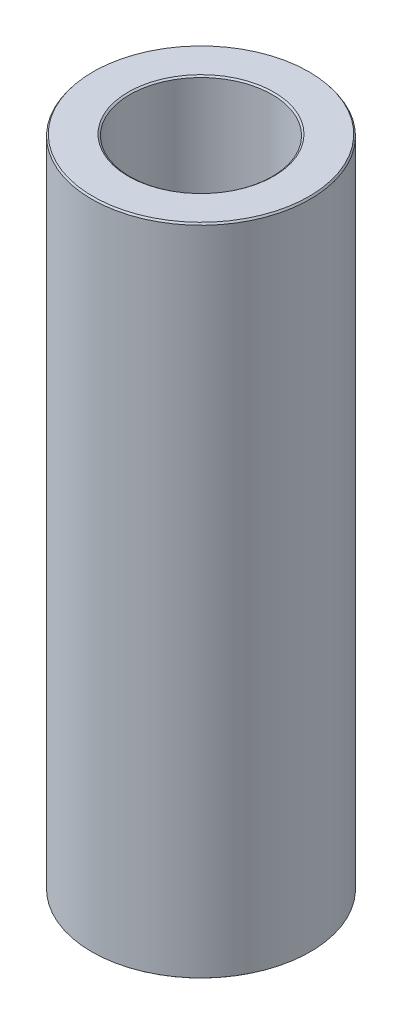
ISO-10303-21;
HEADER;
FILE_DESCRIPTION(('STEP AP214'),'2;1');
FILE_NAME('part.step','',(''),(''),'','','');
FILE_SCHEMA(('AUTOMOTIVE_DESIGN { 1 0 10303 214 1 1 1 1 }'));
ENDSEC;
DATA;
#1=APPLICATION_CONTEXT('core data for automotive mechanical design processes');
#2=APPLICATION_PROTOCOL_DEFINITION('international standard','automotive_design',2000,#1);
#3=PRODUCT_CONTEXT('',#1,'mechanical');
#4=PRODUCT('Part','Part','',(#3));
#5=PRODUCT_RELATED_PRODUCT_CATEGORY('part','',(#4));
#6=PRODUCT_DEFINITION_FORMATION('','',#4);
#7=PRODUCT_DEFINITION_CONTEXT('part definition',#1,'design');
#8=PRODUCT_DEFINITION('design','',#6,#7);
#9=PRODUCT_DEFINITION_SHAPE('','',#8);
#10=(LENGTH_UNIT() NAMED_UNIT(*) SI_UNIT(.MILLI.,.METRE.));
#11=(NAMED_UNIT(*) PLANE_ANGLE_UNIT() SI_UNIT($,.RADIAN.));
#12=(NAMED_UNIT(*) SI_UNIT($,.STERADIAN.) SOLID_ANGLE_UNIT());
#13=UNCERTAINTY_MEASURE_WITH_UNIT(LENGTH_MEASURE(1.E-05),#10,'distance_accuracy_value','');
#14=(GEOMETRIC_REPRESENTATION_CONTEXT(3) GLOBAL_UNCERTAINTY_ASSIGNED_CONTEXT((#13)) GLOBAL_UNIT_ASSIGNED_CONTEXT((#10,
#11,#12)) REPRESENTATION_CONTEXT('',''));
#15=CARTESIAN_POINT('',(0.,0.,0.));
#16=DIRECTION('',(0.,0.,1.));
#17=DIRECTION('',(1.,0.,0.));
#18=AXIS2_PLACEMENT_3D('',#15,#16,#17);
#19=CARTESIAN_POINT('',(0.,299.634023244641,0.));
#20=DIRECTION('',(0.,-1.,0.));
#21=DIRECTION('',(0.,0.,-1.));
#22=AXIS2_PLACEMENT_3D('',#19,#20,#21);
#23=CYLINDRICAL_SURFACE('',#22,50.);
#24=CARTESIAN_POINT('',(0.,0.57929424956632,0.));
#25=DIRECTION('',(0.,1.,0.));
#26=DIRECTION('',(0.,0.,1.));
#27=AXIS2_PLACEMENT_3D('',#24,#25,#26);
#28=CIRCLE('',#27,50.);
#29=CARTESIAN_POINT('',(0.,0.57929424956632,50.));
#30=VERTEX_POINT('',#29);
#31=EDGE_CURVE('E10',#30,#30,#28,.T.);
#32=ORIENTED_EDGE('',*,*,#31,.T.);
#33=EDGE_LOOP('',(#32));
#34=FACE_BOUND('',#33,.T.);
#35=CARTESIAN_POINT('',(0.,298.85136922486,0.));
#36=DIRECTION('',(0.,1.,0.));
#37=DIRECTION('',(0.,0.,1.));
#38=AXIS2_PLACEMENT_3D('',#35,#36,#37);
#39=CIRCLE('',#38,50.);
#40=CARTESIAN_POINT('',(0.,298.85136922486,-50.));
#41=VERTEX_POINT('',#40);
#42=EDGE_CURVE('E50',#41,#41,#39,.F.);
#43=ORIENTED_EDGE('',*,*,#42,.T.);
#44=EDGE_LOOP('',(#43));
#45=FACE_BOUND('',#44,.T.);
#46=ADVANCED_FACE('F39',(#34,#45),#23,.T.);
#47=CARTESIAN_POINT('',(0.,299.634023244641,0.));
#48=DIRECTION('',(0.,1.,0.));
#49=DIRECTION('',(0.,0.,1.));
#50=AXIS2_PLACEMENT_3D('',#47,#48,#49);
#51=PLANE('',#50);
#52=CARTESIAN_POINT('',(0.,299.634023244641,0.));
#53=DIRECTION('',(0.,1.,0.));
#54=DIRECTION('',(0.,0.,1.));
#55=AXIS2_PLACEMENT_3D('',#52,#53,#54);
#56=CIRCLE('',#55,33.3396743396047);
#57=CARTESIAN_POINT('',(0.,299.634023244641,33.3396743396047));
#58=VERTEX_POINT('',#57);
#59=EDGE_CURVE('E58',#58,#58,#56,.F.);
#60=ORIENTED_EDGE('',*,*,#59,.T.);
#61=EDGE_LOOP('',(#60));
#62=FACE_BOUND('',#61,.T.);
#63=CARTESIAN_POINT('',(0.,299.634023244641,0.));
#64=DIRECTION('',(0.,1.,0.));
#65=DIRECTION('',(0.,0.,1.));
#66=AXIS2_PLACEMENT_3D('',#63,#64,#65);
#67=CIRCLE('',#66,49.4207057504337);
#68=CARTESIAN_POINT('',(0.,299.634023244641,-49.4207057504338));
#69=VERTEX_POINT('',#68);
#70=EDGE_CURVE('E61',#69,#69,#67,.T.);
#71=ORIENTED_EDGE('',*,*,#70,.T.);
#72=EDGE_LOOP('',(#71));
#73=FACE_BOUND('',#72,.T.);
#74=ADVANCED_FACE('F88',(#62,#73),#51,.T.);
#75=CARTESIAN_POINT('',(0.,0.,0.));
#76=DIRECTION('',(0.,1.,0.));
#77=DIRECTION('',(0.,0.,1.));
#78=AXIS2_PLACEMENT_3D('',#75,#76,#77);
#79=PLANE('',#78);
#80=CARTESIAN_POINT('',(0.,0.,0.));
#81=DIRECTION('',(0.,1.,0.));
#82=DIRECTION('',(0.,0.,1.));
#83=AXIS2_PLACEMENT_3D('',#80,#81,#82);
#84=CIRCLE('',#83,33.136314569389);
#85=CARTESIAN_POINT('',(0.,0.,33.136314569389));
#86=VERTEX_POINT('',#85);
#87=EDGE_CURVE('E51',#86,#86,#84,.T.);
#88=ORIENTED_EDGE('',*,*,#87,.T.);
#89=EDGE_LOOP('',(#88));
#90=FACE_BOUND('',#89,.T.);
#91=CARTESIAN_POINT('',(0.,0.,0.));
#92=DIRECTION('',(0.,1.,0.));
#93=DIRECTION('',(0.,0.,1.));
#94=AXIS2_PLACEMENT_3D('',#91,#92,#93);
#95=CIRCLE('',#94,49.217345980218);
#96=CARTESIAN_POINT('',(0.,0.,49.217345980218));
#97=VERTEX_POINT('',#96);
#98=EDGE_CURVE('E54',#97,#97,#95,.F.);
#99=ORIENTED_EDGE('',*,*,#98,.T.);
#100=EDGE_LOOP('',(#99));
#101=FACE_BOUND('',#100,.T.);
#102=ADVANCED_FACE('F83',(#90,#101),#79,.F.);
#103=CARTESIAN_POINT('',(0.,299.634023244641,0.));
#104=DIRECTION('',(0.,-1.,0.));
#105=DIRECTION('',(0.,0.,-1.));
#106=AXIS2_PLACEMENT_3D('',#103,#104,#105);
#107=CYLINDRICAL_SURFACE('',#106,32.5570203198227);
#108=CARTESIAN_POINT('',(0.,299.054728995075,0.));
#109=DIRECTION('',(0.,1.,0.));
#110=DIRECTION('',(0.,0.,1.));
#111=AXIS2_PLACEMENT_3D('',#108,#109,#110);
#112=CIRCLE('',#111,32.5570203198227);
#113=CARTESIAN_POINT('',(0.,299.054728995075,32.5570203198227));
#114=VERTEX_POINT('',#113);
#115=EDGE_CURVE('E67',#114,#114,#112,.T.);
#116=ORIENTED_EDGE('',*,*,#115,.T.);
#117=EDGE_LOOP('',(#116));
#118=FACE_BOUND('',#117,.T.);
#119=CARTESIAN_POINT('',(0.,0.782654019781948,0.));
#120=DIRECTION('',(0.,1.,0.));
#121=DIRECTION('',(0.,0.,1.));
#122=AXIS2_PLACEMENT_3D('',#119,#120,#121);
#123=CIRCLE('',#122,32.5570203198227);
#124=CARTESIAN_POINT('',(0.,0.782654019781948,32.5570203198227));
#125=VERTEX_POINT('',#124);
#126=EDGE_CURVE('E69',#125,#125,#123,.F.);
#127=ORIENTED_EDGE('',*,*,#126,.T.);
#128=EDGE_LOOP('',(#127));
#129=FACE_BOUND('',#128,.T.);
#130=ADVANCED_FACE('F71',(#118,#129),#107,.F.);
#131=CARTESIAN_POINT('',(0.,299.054728995075,0.));
#132=DIRECTION('',(0.,1.,0.));
#133=DIRECTION('',(0.,0.,1.));
#134=AXIS2_PLACEMENT_3D('',#131,#132,#133);
#135=CONICAL_SURFACE('',#134,32.5570203198227,0.933618450659609);
#136=ORIENTED_EDGE('',*,*,#59,.F.);
#137=EDGE_LOOP('',(#136));
#138=FACE_BOUND('',#137,.T.);
#139=ORIENTED_EDGE('',*,*,#115,.F.);
#140=EDGE_LOOP('',(#139));
#141=FACE_BOUND('',#140,.T.);
#142=ADVANCED_FACE('F77',(#138,#141),#135,.F.);
#143=CARTESIAN_POINT('',(0.,0.,0.));
#144=DIRECTION('',(0.,-1.,0.));
#145=DIRECTION('',(0.,0.,-1.));
#146=AXIS2_PLACEMENT_3D('',#143,#144,#145);
#147=CONICAL_SURFACE('',#146,33.136314569389,0.637177876135292);
#148=ORIENTED_EDGE('',*,*,#126,.F.);
#149=EDGE_LOOP('',(#148));
#150=FACE_BOUND('',#149,.T.);
#151=ORIENTED_EDGE('',*,*,#87,.F.);
#152=EDGE_LOOP('',(#151));
#153=FACE_BOUND('',#152,.T.);
#154=ADVANCED_FACE('F73',(#150,#153),#147,.F.);
#155=CARTESIAN_POINT('',(0.,0.57929424956632,0.));
#156=DIRECTION('',(0.,1.,0.));
#157=DIRECTION('',(0.,0.,1.));
#158=AXIS2_PLACEMENT_3D('',#155,#156,#157);
#159=CONICAL_SURFACE('',#158,50.,0.933618450659642);
#160=ORIENTED_EDGE('',*,*,#98,.F.);
#161=EDGE_LOOP('',(#160));
#162=FACE_BOUND('',#161,.T.);
#163=ORIENTED_EDGE('',*,*,#31,.F.);
#164=EDGE_LOOP('',(#163));
#165=FACE_BOUND('',#164,.T.);
#166=ADVANCED_FACE('F76',(#162,#165),#159,.T.);
#167=CARTESIAN_POINT('',(0.,299.634023244641,0.));
#168=DIRECTION('',(0.,-1.,0.));
#169=DIRECTION('',(0.,0.,-1.));
#170=AXIS2_PLACEMENT_3D('',#167,#168,#169);
#171=CONICAL_SURFACE('',#170,49.4207057504337,0.637177876135291);
#172=CARTESIAN_POINT('',(0.,298.85136922486,-50.));
#173=CARTESIAN_POINT('',(0.,298.859521870899,-49.9939656849004));
#174=CARTESIAN_POINT('',(0.,298.867674516938,-49.9879313698007));
#175=CARTESIAN_POINT('',(0.,298.883979809017,-49.9758627396014));
#176=CARTESIAN_POINT('',(0.,298.892132455056,-49.9698284245018));
#177=CARTESIAN_POINT('',(0.,298.908437747135,-49.9577597943025));
#178=CARTESIAN_POINT('',(0.,298.916590393175,-49.9517254792028));
#179=CARTESIAN_POINT('',(0.,298.932895685253,-49.9396568490035));
#180=CARTESIAN_POINT('',(0.,298.941048331293,-49.9336225339039));
#181=CARTESIAN_POINT('',(0.,298.957353623372,-49.9215539037046));
#182=CARTESIAN_POINT('',(0.,298.965506269411,-49.9155195886049));
#183=CARTESIAN_POINT('',(0.,298.98181156149,-49.9034509584056));
#184=CARTESIAN_POINT('',(0.,298.989964207529,-49.897416643306));
#185=CARTESIAN_POINT('',(0.,299.006269499608,-49.8853480131067));
#186=CARTESIAN_POINT('',(0.,299.014422145647,-49.8793136980071));
#187=CARTESIAN_POINT('',(0.,299.030727437726,-49.8672450678078));
#188=CARTESIAN_POINT('',(0.,299.038880083766,-49.8612107527081));
#189=CARTESIAN_POINT('',(0.,299.055185375844,-49.8491421225088));
#190=CARTESIAN_POINT('',(0.,299.063338021884,-49.8431078074092));
#191=CARTESIAN_POINT('',(0.,299.079643313962,-49.8310391772099));
#192=CARTESIAN_POINT('',(0.,299.087795960002,-49.8250048621102));
#193=CARTESIAN_POINT('',(0.,299.104101252081,-49.8129362319109));
#194=CARTESIAN_POINT('',(0.,299.11225389812,-49.8069019168113));
#195=CARTESIAN_POINT('',(0.,299.128559190199,-49.794833286612));
#196=CARTESIAN_POINT('',(0.,299.136711836238,-49.7887989715123));
#197=CARTESIAN_POINT('',(0.,299.153017128317,-49.776730341313));
#198=CARTESIAN_POINT('',(0.,299.161169774356,-49.7706960262134));
#199=CARTESIAN_POINT('',(0.,299.177475066435,-49.7586273960141));
#200=CARTESIAN_POINT('',(0.,299.185627712475,-49.7525930809144));
#201=CARTESIAN_POINT('',(0.,299.201933004553,-49.7405244507151));
#202=CARTESIAN_POINT('',(0.,299.210085650593,-49.7344901356155));
#203=CARTESIAN_POINT('',(0.,299.226390942672,-49.7224215054162));
#204=CARTESIAN_POINT('',(0.,299.234543588711,-49.7163871903165));
#205=CARTESIAN_POINT('',(0.,299.25084888079,-49.7043185601172));
#206=CARTESIAN_POINT('',(0.,299.259001526829,-49.6982842450176));
#207=CARTESIAN_POINT('',(0.,299.275306818908,-49.6862156148183));
#208=CARTESIAN_POINT('',(0.,299.283459464947,-49.6801812997186));
#209=CARTESIAN_POINT('',(0.,299.299764757026,-49.6681126695193));
#210=CARTESIAN_POINT('',(0.,299.307917403066,-49.6620783544197));
#211=CARTESIAN_POINT('',(0.,299.324222695144,-49.6500097242204));
#212=CARTESIAN_POINT('',(0.,299.332375341184,-49.6439754091207));
#213=CARTESIAN_POINT('',(0.,299.348680633262,-49.6319067789215));
#214=CARTESIAN_POINT('',(0.,299.356833279302,-49.6258724638218));
#215=CARTESIAN_POINT('',(0.,299.373138571381,-49.6138038336225));
#216=CARTESIAN_POINT('',(0.,299.38129121742,-49.6077695185229));
#217=CARTESIAN_POINT('',(0.,299.397596509499,-49.5957008883236));
#218=CARTESIAN_POINT('',(0.,299.405749155538,-49.5896665732239));
#219=CARTESIAN_POINT('',(0.,299.422054447617,-49.5775979430246));
#220=CARTESIAN_POINT('',(0.,299.430207093656,-49.571563627925));
#221=CARTESIAN_POINT('',(0.,299.446512385735,-49.5594949977257));
#222=CARTESIAN_POINT('',(0.,299.454665031775,-49.553460682626));
#223=CARTESIAN_POINT('',(0.,299.470970323853,-49.5413920524267));
#224=CARTESIAN_POINT('',(0.,299.479122969893,-49.5353577373271));
#225=CARTESIAN_POINT('',(0.,299.495428261972,-49.5232891071278));
#226=CARTESIAN_POINT('',(0.,299.503580908011,-49.5172547920281));
#227=CARTESIAN_POINT('',(0.,299.51988620009,-49.5051861618288));
#228=CARTESIAN_POINT('',(0.,299.528038846129,-49.4991518467292));
#229=CARTESIAN_POINT('',(0.,299.544344138208,-49.4870832165299));
#230=CARTESIAN_POINT('',(0.,299.552496784247,-49.4810489014302));
#231=CARTESIAN_POINT('',(0.,299.568802076326,-49.4689802712309));
#232=CARTESIAN_POINT('',(0.,299.576954722366,-49.4629459561313));
#233=CARTESIAN_POINT('',(0.,299.593260014444,-49.450877325932));
#234=CARTESIAN_POINT('',(0.,299.601412660484,-49.4448430108323));
#235=CARTESIAN_POINT('',(0.,299.617717952563,-49.432774380633));
#236=CARTESIAN_POINT('',(0.,299.625870598602,-49.4267400655334));
#237=CARTESIAN_POINT('',(0.,299.634023244641,-49.4207057504338));
#238=B_SPLINE_CURVE_WITH_KNOTS('',3,(#172,#173,#174,#175,#176,#177,#178,#179,#180,#181,#182,
#183,#184,#185,#186,#187,#188,#189,#190,#191,#192,#193,#194,#195,#196,#197,#198,#199,#200,#201,
#202,#203,#204,#205,#206,#207,#208,#209,#210,#211,#212,#213,#214,#215,#216,#217,#218,#219,#220,
#221,#222,#223,#224,#225,#226,#227,#228,#229,#230,#231,#232,#233,#234,#235,#236,#237),
.UNSPECIFIED.,.F.,.F.,(4,2,2,2,2,2,2,2,2,2,2,2,2,2,2,2,2,2,2,2,2,2,2,2,2,2,2,2,2,2,2,2,4),(0.,
0.0304287259918827,0.0608574519837613,0.091286177975644,0.121714903967523,0.152143629959405,
0.182572355951328,0.213001081943211,0.24342980793509,0.273858533926973,0.304287259918851,
0.334715985910778,0.365144711902657,0.39557343789454,0.426002163886418,0.456430889878301,
0.486859615870228,0.517288341862107,0.54771706785399,0.578145793845868,0.608574519837751,
0.639003245829629,0.669431971821557,0.699860697813435,0.730289423805318,0.760718149797197,
0.791146875789079,0.821575601781003,0.852004327772885,0.882433053764764,0.912861779756647,
0.943290505748529,0.973719231740452),.UNSPECIFIED.);
#239=EDGE_CURVE('BSEAM45',#41,#69,#238,.T.);
#240=ORIENTED_EDGE('',*,*,#42,.F.);
#241=ORIENTED_EDGE('',*,*,#70,.F.);
#242=ORIENTED_EDGE('',*,*,#239,.T.);
#243=ORIENTED_EDGE('',*,*,#239,.F.);
#244=EDGE_LOOP('',(#240,#242,#241,#243));
#245=FACE_BOUND('',#244,.T.);
#246=ADVANCED_FACE('F45',(#245),#171,.T.);
#247=CLOSED_SHELL('',(#46,#74,#102,#130,#142,#154,#166,#246));
#248=MANIFOLD_SOLID_BREP('B2',#247);
#249=ADVANCED_BREP_SHAPE_REPRESENTATION('',(#18,#248),#14);
#250=SHAPE_DEFINITION_REPRESENTATION(#9,#249);
ENDSEC;
END-ISO-10303-21;
